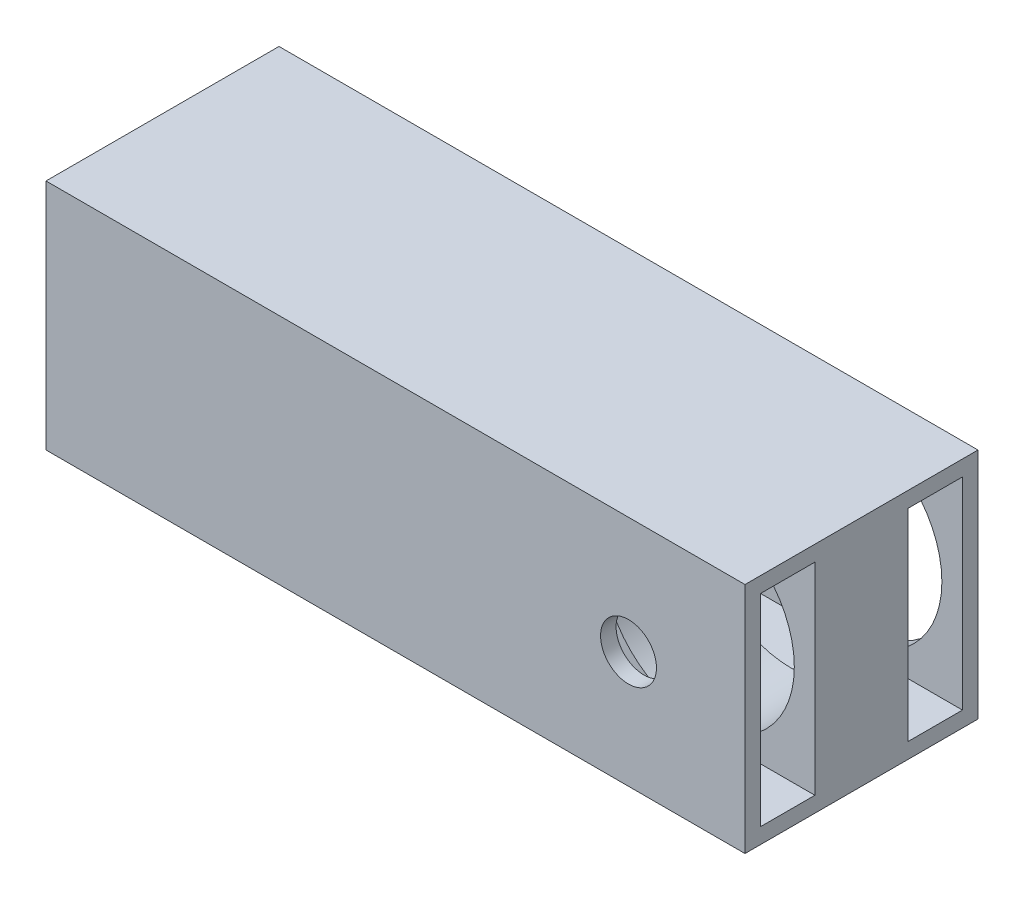
ISO-10303-21;
HEADER;
FILE_DESCRIPTION(('STEP AP214'),'2;1');
FILE_NAME('part.step','',(''),(''),'','','');
FILE_SCHEMA(('AUTOMOTIVE_DESIGN { 1 0 10303 214 1 1 1 1 }'));
ENDSEC;
DATA;
#1=APPLICATION_CONTEXT('core data for automotive mechanical design processes');
#2=APPLICATION_PROTOCOL_DEFINITION('international standard','automotive_design',2000,#1);
#3=PRODUCT_CONTEXT('',#1,'mechanical');
#4=PRODUCT('Part','Part','',(#3));
#5=PRODUCT_RELATED_PRODUCT_CATEGORY('part','',(#4));
#6=PRODUCT_DEFINITION_FORMATION('','',#4);
#7=PRODUCT_DEFINITION_CONTEXT('part definition',#1,'design');
#8=PRODUCT_DEFINITION('design','',#6,#7);
#9=PRODUCT_DEFINITION_SHAPE('','',#8);
#10=(LENGTH_UNIT() NAMED_UNIT(*) SI_UNIT(.MILLI.,.METRE.));
#11=(NAMED_UNIT(*) PLANE_ANGLE_UNIT() SI_UNIT($,.RADIAN.));
#12=(NAMED_UNIT(*) SI_UNIT($,.STERADIAN.) SOLID_ANGLE_UNIT());
#13=UNCERTAINTY_MEASURE_WITH_UNIT(LENGTH_MEASURE(1.E-05),#10,'distance_accuracy_value','');
#14=(GEOMETRIC_REPRESENTATION_CONTEXT(3) GLOBAL_UNCERTAINTY_ASSIGNED_CONTEXT((#13)) GLOBAL_UNIT_ASSIGNED_CONTEXT((#10,
#11,#12)) REPRESENTATION_CONTEXT('',''));
#15=CARTESIAN_POINT('',(0.,0.,0.));
#16=DIRECTION('',(0.,0.,1.));
#17=DIRECTION('',(1.,0.,0.));
#18=AXIS2_PLACEMENT_3D('',#15,#16,#17);
#19=CARTESIAN_POINT('',(90.,0.,0.));
#20=DIRECTION('',(-1.,0.,0.));
#21=DIRECTION('',(0.,0.,1.));
#22=AXIS2_PLACEMENT_3D('',#19,#20,#21);
#23=PLANE('',#22);
#24=DIRECTION('',(0.,-1.,0.));
#25=VECTOR('',#24,1.);
#26=CARTESIAN_POINT('',(90.,13.,13.));
#27=LINE('',#26,#25);
#28=CARTESIAN_POINT('',(90.,13.,13.));
#29=VERTEX_POINT('',#28);
#30=CARTESIAN_POINT('',(90.,-13.,13.));
#31=VERTEX_POINT('',#30);
#32=EDGE_CURVE('E168',#29,#31,#27,.T.);
#33=ORIENTED_EDGE('',*,*,#32,.F.);
#34=DIRECTION('',(0.,0.,1.));
#35=VECTOR('',#34,1.);
#36=CARTESIAN_POINT('',(90.,13.,13.));
#37=LINE('',#36,#35);
#38=CARTESIAN_POINT('',(90.,13.,6.));
#39=VERTEX_POINT('',#38);
#40=EDGE_CURVE('E176',#39,#29,#37,.T.);
#41=ORIENTED_EDGE('',*,*,#40,.F.);
#42=DIRECTION('',(0.,1.,0.));
#43=VECTOR('',#42,1.);
#44=CARTESIAN_POINT('',(90.,13.,6.));
#45=LINE('',#44,#43);
#46=CARTESIAN_POINT('',(90.,-13.,6.));
#47=VERTEX_POINT('',#46);
#48=EDGE_CURVE('E173',#47,#39,#45,.T.);
#49=ORIENTED_EDGE('',*,*,#48,.F.);
#50=DIRECTION('',(0.,0.,-1.));
#51=VECTOR('',#50,1.);
#52=CARTESIAN_POINT('',(90.,-13.,13.));
#53=LINE('',#52,#51);
#54=EDGE_CURVE('E170',#31,#47,#53,.T.);
#55=ORIENTED_EDGE('',*,*,#54,.F.);
#56=EDGE_LOOP('',(#33,#41,#49,#55));
#57=FACE_BOUND('',#56,.T.);
#58=DIRECTION('',(0.,1.,0.));
#59=VECTOR('',#58,1.);
#60=CARTESIAN_POINT('',(90.,-15.,-15.));
#61=LINE('',#60,#59);
#62=CARTESIAN_POINT('',(90.,-15.,-15.));
#63=VERTEX_POINT('',#62);
#64=CARTESIAN_POINT('',(90.,15.,-15.));
#65=VERTEX_POINT('',#64);
#66=EDGE_CURVE('E199',#63,#65,#61,.T.);
#67=ORIENTED_EDGE('',*,*,#66,.T.);
#68=DIRECTION('',(0.,0.,1.));
#69=VECTOR('',#68,1.);
#70=CARTESIAN_POINT('',(90.,15.,15.));
#71=LINE('',#70,#69);
#72=CARTESIAN_POINT('',(90.,15.,15.));
#73=VERTEX_POINT('',#72);
#74=EDGE_CURVE('E202',#65,#73,#71,.T.);
#75=ORIENTED_EDGE('',*,*,#74,.T.);
#76=DIRECTION('',(0.,-1.,0.));
#77=VECTOR('',#76,1.);
#78=CARTESIAN_POINT('',(90.,-15.,15.));
#79=LINE('',#78,#77);
#80=CARTESIAN_POINT('',(90.,-15.,15.));
#81=VERTEX_POINT('',#80);
#82=EDGE_CURVE('E205',#73,#81,#79,.T.);
#83=ORIENTED_EDGE('',*,*,#82,.T.);
#84=DIRECTION('',(0.,0.,-1.));
#85=VECTOR('',#84,1.);
#86=CARTESIAN_POINT('',(90.,-15.,15.));
#87=LINE('',#86,#85);
#88=EDGE_CURVE('E207',#81,#63,#87,.T.);
#89=ORIENTED_EDGE('',*,*,#88,.T.);
#90=EDGE_LOOP('',(#67,#75,#83,#89));
#91=FACE_BOUND('',#90,.T.);
#92=DIRECTION('',(0.,1.,0.));
#93=VECTOR('',#92,1.);
#94=CARTESIAN_POINT('',(90.,13.,-13.));
#95=LINE('',#94,#93);
#96=CARTESIAN_POINT('',(90.,-13.,-13.));
#97=VERTEX_POINT('',#96);
#98=CARTESIAN_POINT('',(90.,13.,-13.));
#99=VERTEX_POINT('',#98);
#100=EDGE_CURVE('E130',#97,#99,#95,.T.);
#101=ORIENTED_EDGE('',*,*,#100,.F.);
#102=DIRECTION('',(0.,0.,-1.));
#103=VECTOR('',#102,1.);
#104=CARTESIAN_POINT('',(90.,-13.,-13.));
#105=LINE('',#104,#103);
#106=CARTESIAN_POINT('',(90.,-13.,-6.));
#107=VERTEX_POINT('',#106);
#108=EDGE_CURVE('E152',#107,#97,#105,.T.);
#109=ORIENTED_EDGE('',*,*,#108,.F.);
#110=DIRECTION('',(0.,-1.,0.));
#111=VECTOR('',#110,1.);
#112=CARTESIAN_POINT('',(90.,13.,-6.));
#113=LINE('',#112,#111);
#114=CARTESIAN_POINT('',(90.,13.,-6.));
#115=VERTEX_POINT('',#114);
#116=EDGE_CURVE('E150',#115,#107,#113,.T.);
#117=ORIENTED_EDGE('',*,*,#116,.F.);
#118=DIRECTION('',(0.,0.,1.));
#119=VECTOR('',#118,1.);
#120=CARTESIAN_POINT('',(90.,13.,-13.));
#121=LINE('',#120,#119);
#122=EDGE_CURVE('E138',#99,#115,#121,.T.);
#123=ORIENTED_EDGE('',*,*,#122,.F.);
#124=EDGE_LOOP('',(#101,#109,#117,#123));
#125=FACE_BOUND('',#124,.T.);
#126=ADVANCED_FACE('F39',(#57,#91,#125),#23,.F.);
#127=CARTESIAN_POINT('',(0.,0.,0.));
#128=DIRECTION('',(-1.,0.,0.));
#129=DIRECTION('',(0.,0.,1.));
#130=AXIS2_PLACEMENT_3D('',#127,#128,#129);
#131=PLANE('',#130);
#132=DIRECTION('',(0.,1.,0.));
#133=VECTOR('',#132,1.);
#134=CARTESIAN_POINT('',(0.,-15.,-15.));
#135=LINE('',#134,#133);
#136=CARTESIAN_POINT('',(0.,-15.,-15.));
#137=VERTEX_POINT('',#136);
#138=CARTESIAN_POINT('',(0.,15.,-15.));
#139=VERTEX_POINT('',#138);
#140=EDGE_CURVE('E198',#137,#139,#135,.T.);
#141=ORIENTED_EDGE('',*,*,#140,.F.);
#142=DIRECTION('',(0.,0.,-1.));
#143=VECTOR('',#142,1.);
#144=CARTESIAN_POINT('',(0.,-15.,15.));
#145=LINE('',#144,#143);
#146=CARTESIAN_POINT('',(0.,-15.,15.));
#147=VERTEX_POINT('',#146);
#148=EDGE_CURVE('E203',#147,#137,#145,.T.);
#149=ORIENTED_EDGE('',*,*,#148,.F.);
#150=DIRECTION('',(0.,-1.,0.));
#151=VECTOR('',#150,1.);
#152=CARTESIAN_POINT('',(0.,-15.,15.));
#153=LINE('',#152,#151);
#154=CARTESIAN_POINT('',(0.,15.,15.));
#155=VERTEX_POINT('',#154);
#156=EDGE_CURVE('E214',#155,#147,#153,.T.);
#157=ORIENTED_EDGE('',*,*,#156,.F.);
#158=DIRECTION('',(0.,0.,1.));
#159=VECTOR('',#158,1.);
#160=CARTESIAN_POINT('',(0.,15.,15.));
#161=LINE('',#160,#159);
#162=EDGE_CURVE('E212',#139,#155,#161,.T.);
#163=ORIENTED_EDGE('',*,*,#162,.F.);
#164=EDGE_LOOP('',(#141,#149,#157,#163));
#165=FACE_BOUND('',#164,.T.);
#166=DIRECTION('',(0.,0.,1.));
#167=VECTOR('',#166,1.);
#168=CARTESIAN_POINT('',(0.,13.,13.));
#169=LINE('',#168,#167);
#170=CARTESIAN_POINT('',(0.,13.,6.));
#171=VERTEX_POINT('',#170);
#172=CARTESIAN_POINT('',(0.,13.,13.));
#173=VERTEX_POINT('',#172);
#174=EDGE_CURVE('E171',#171,#173,#169,.T.);
#175=ORIENTED_EDGE('',*,*,#174,.T.);
#176=DIRECTION('',(0.,-1.,0.));
#177=VECTOR('',#176,1.);
#178=CARTESIAN_POINT('',(0.,13.,13.));
#179=LINE('',#178,#177);
#180=CARTESIAN_POINT('',(0.,-13.,13.));
#181=VERTEX_POINT('',#180);
#182=EDGE_CURVE('E146',#173,#181,#179,.T.);
#183=ORIENTED_EDGE('',*,*,#182,.T.);
#184=DIRECTION('',(0.,0.,-1.));
#185=VECTOR('',#184,1.);
#186=CARTESIAN_POINT('',(0.,-13.,13.));
#187=LINE('',#186,#185);
#188=CARTESIAN_POINT('',(0.,-13.,6.));
#189=VERTEX_POINT('',#188);
#190=EDGE_CURVE('E181',#181,#189,#187,.T.);
#191=ORIENTED_EDGE('',*,*,#190,.T.);
#192=DIRECTION('',(0.,1.,0.));
#193=VECTOR('',#192,1.);
#194=CARTESIAN_POINT('',(0.,13.,6.));
#195=LINE('',#194,#193);
#196=EDGE_CURVE('E184',#189,#171,#195,.T.);
#197=ORIENTED_EDGE('',*,*,#196,.T.);
#198=EDGE_LOOP('',(#175,#183,#191,#197));
#199=FACE_BOUND('',#198,.T.);
#200=DIRECTION('',(0.,0.,-1.));
#201=VECTOR('',#200,1.);
#202=CARTESIAN_POINT('',(0.,-13.,-13.));
#203=LINE('',#202,#201);
#204=CARTESIAN_POINT('',(0.,-13.,-6.));
#205=VERTEX_POINT('',#204);
#206=CARTESIAN_POINT('',(0.,-13.,-13.));
#207=VERTEX_POINT('',#206);
#208=EDGE_CURVE('E139',#205,#207,#203,.T.);
#209=ORIENTED_EDGE('',*,*,#208,.T.);
#210=DIRECTION('',(0.,1.,0.));
#211=VECTOR('',#210,1.);
#212=CARTESIAN_POINT('',(0.,13.,-13.));
#213=LINE('',#212,#211);
#214=CARTESIAN_POINT('',(0.,13.,-13.));
#215=VERTEX_POINT('',#214);
#216=EDGE_CURVE('E64',#207,#215,#213,.T.);
#217=ORIENTED_EDGE('',*,*,#216,.T.);
#218=DIRECTION('',(0.,0.,1.));
#219=VECTOR('',#218,1.);
#220=CARTESIAN_POINT('',(0.,13.,-13.));
#221=LINE('',#220,#219);
#222=CARTESIAN_POINT('',(0.,13.,-6.));
#223=VERTEX_POINT('',#222);
#224=EDGE_CURVE('E145',#215,#223,#221,.T.);
#225=ORIENTED_EDGE('',*,*,#224,.T.);
#226=DIRECTION('',(0.,-1.,0.));
#227=VECTOR('',#226,1.);
#228=CARTESIAN_POINT('',(0.,13.,-6.));
#229=LINE('',#228,#227);
#230=EDGE_CURVE('E160',#223,#205,#229,.T.);
#231=ORIENTED_EDGE('',*,*,#230,.T.);
#232=EDGE_LOOP('',(#209,#217,#225,#231));
#233=FACE_BOUND('',#232,.T.);
#234=ADVANCED_FACE('F254',(#165,#199,#233),#131,.T.);
#235=CARTESIAN_POINT('',(90.,-15.,-15.));
#236=DIRECTION('',(0.,0.,1.));
#237=DIRECTION('',(1.,0.,0.));
#238=AXIS2_PLACEMENT_3D('',#235,#236,#237);
#239=PLANE('',#238);
#240=CARTESIAN_POINT('',(75.,0.,-15.));
#241=DIRECTION('',(0.,0.,-1.));
#242=DIRECTION('',(-1.,0.,0.));
#243=AXIS2_PLACEMENT_3D('',#240,#241,#242);
#244=CIRCLE('',#243,12.35);
#245=CARTESIAN_POINT('',(62.65,0.,-15.));
#246=VERTEX_POINT('',#245);
#247=EDGE_CURVE('E226',#246,#246,#244,.T.);
#248=ORIENTED_EDGE('',*,*,#247,.F.);
#249=EDGE_LOOP('',(#248));
#250=FACE_BOUND('',#249,.T.);
#251=ORIENTED_EDGE('',*,*,#140,.T.);
#252=DIRECTION('',(-1.,0.,0.));
#253=VECTOR('',#252,1.);
#254=CARTESIAN_POINT('',(90.,15.,-15.));
#255=LINE('',#254,#253);
#256=EDGE_CURVE('E11',#65,#139,#255,.T.);
#257=ORIENTED_EDGE('',*,*,#256,.F.);
#258=ORIENTED_EDGE('',*,*,#66,.F.);
#259=DIRECTION('',(-1.,0.,0.));
#260=VECTOR('',#259,1.);
#261=CARTESIAN_POINT('',(90.,-15.,-15.));
#262=LINE('',#261,#260);
#263=EDGE_CURVE('E209',#63,#137,#262,.T.);
#264=ORIENTED_EDGE('',*,*,#263,.T.);
#265=EDGE_LOOP('',(#251,#257,#258,#264));
#266=FACE_BOUND('',#265,.T.);
#267=ADVANCED_FACE('F41',(#250,#266),#239,.F.);
#268=CARTESIAN_POINT('',(90.,15.,15.));
#269=DIRECTION('',(0.,-1.,0.));
#270=DIRECTION('',(0.,0.,-1.));
#271=AXIS2_PLACEMENT_3D('',#268,#269,#270);
#272=PLANE('',#271);
#273=ORIENTED_EDGE('',*,*,#162,.T.);
#274=DIRECTION('',(-1.,0.,0.));
#275=VECTOR('',#274,1.);
#276=CARTESIAN_POINT('',(90.,15.,15.));
#277=LINE('',#276,#275);
#278=EDGE_CURVE('E48',#73,#155,#277,.T.);
#279=ORIENTED_EDGE('',*,*,#278,.F.);
#280=ORIENTED_EDGE('',*,*,#74,.F.);
#281=ORIENTED_EDGE('',*,*,#256,.T.);
#282=EDGE_LOOP('',(#273,#279,#280,#281));
#283=FACE_BOUND('',#282,.T.);
#284=ADVANCED_FACE('F292',(#283),#272,.F.);
#285=CARTESIAN_POINT('',(90.,-15.,15.));
#286=DIRECTION('',(0.,0.,-1.));
#287=DIRECTION('',(-1.,0.,0.));
#288=AXIS2_PLACEMENT_3D('',#285,#286,#287);
#289=PLANE('',#288);
#290=CARTESIAN_POINT('',(75.,0.,15.));
#291=DIRECTION('',(0.,0.,1.));
#292=DIRECTION('',(1.,0.,0.));
#293=AXIS2_PLACEMENT_3D('',#290,#291,#292);
#294=CIRCLE('',#293,3.6);
#295=CARTESIAN_POINT('',(78.6,0.,15.));
#296=VERTEX_POINT('',#295);
#297=EDGE_CURVE('E236',#296,#296,#294,.T.);
#298=ORIENTED_EDGE('',*,*,#297,.F.);
#299=EDGE_LOOP('',(#298));
#300=FACE_BOUND('',#299,.T.);
#301=ORIENTED_EDGE('',*,*,#156,.T.);
#302=DIRECTION('',(-1.,0.,0.));
#303=VECTOR('',#302,1.);
#304=CARTESIAN_POINT('',(90.,-15.,15.));
#305=LINE('',#304,#303);
#306=EDGE_CURVE('E219',#81,#147,#305,.T.);
#307=ORIENTED_EDGE('',*,*,#306,.F.);
#308=ORIENTED_EDGE('',*,*,#82,.F.);
#309=ORIENTED_EDGE('',*,*,#278,.T.);
#310=EDGE_LOOP('',(#301,#307,#308,#309));
#311=FACE_BOUND('',#310,.T.);
#312=ADVANCED_FACE('F289',(#300,#311),#289,.F.);
#313=CARTESIAN_POINT('',(90.,-15.,15.));
#314=DIRECTION('',(0.,1.,0.));
#315=DIRECTION('',(0.,0.,1.));
#316=AXIS2_PLACEMENT_3D('',#313,#314,#315);
#317=PLANE('',#316);
#318=ORIENTED_EDGE('',*,*,#148,.T.);
#319=ORIENTED_EDGE('',*,*,#263,.F.);
#320=ORIENTED_EDGE('',*,*,#88,.F.);
#321=ORIENTED_EDGE('',*,*,#306,.T.);
#322=EDGE_LOOP('',(#318,#319,#320,#321));
#323=FACE_BOUND('',#322,.T.);
#324=ADVANCED_FACE('F286',(#323),#317,.F.);
#325=CARTESIAN_POINT('',(90.,13.,13.));
#326=DIRECTION('',(0.,0.,-1.));
#327=DIRECTION('',(0.,1.,0.));
#328=AXIS2_PLACEMENT_3D('',#325,#326,#327);
#329=PLANE('',#328);
#330=CARTESIAN_POINT('',(75.,0.,13.));
#331=DIRECTION('',(0.,0.,-1.));
#332=DIRECTION('',(0.,1.,0.));
#333=AXIS2_PLACEMENT_3D('',#330,#331,#332);
#334=CIRCLE('',#333,3.6);
#335=CARTESIAN_POINT('',(75.,3.6,13.));
#336=VERTEX_POINT('',#335);
#337=EDGE_CURVE('E43',#336,#336,#334,.T.);
#338=ORIENTED_EDGE('',*,*,#337,.F.);
#339=EDGE_LOOP('',(#338));
#340=FACE_BOUND('',#339,.T.);
#341=ORIENTED_EDGE('',*,*,#182,.F.);
#342=DIRECTION('',(-1.,0.,0.));
#343=VECTOR('',#342,1.);
#344=CARTESIAN_POINT('',(90.,13.,13.));
#345=LINE('',#344,#343);
#346=EDGE_CURVE('E178',#29,#173,#345,.T.);
#347=ORIENTED_EDGE('',*,*,#346,.F.);
#348=ORIENTED_EDGE('',*,*,#32,.T.);
#349=DIRECTION('',(-1.,0.,0.));
#350=VECTOR('',#349,1.);
#351=CARTESIAN_POINT('',(90.,-13.,13.));
#352=LINE('',#351,#350);
#353=EDGE_CURVE('E195',#31,#181,#352,.T.);
#354=ORIENTED_EDGE('',*,*,#353,.T.);
#355=EDGE_LOOP('',(#341,#347,#348,#354));
#356=FACE_BOUND('',#355,.T.);
#357=ADVANCED_FACE('F260',(#340,#356),#329,.T.);
#358=CARTESIAN_POINT('',(90.,-13.,13.));
#359=DIRECTION('',(0.,1.,0.));
#360=DIRECTION('',(0.,0.,1.));
#361=AXIS2_PLACEMENT_3D('',#358,#359,#360);
#362=PLANE('',#361);
#363=ORIENTED_EDGE('',*,*,#190,.F.);
#364=ORIENTED_EDGE('',*,*,#353,.F.);
#365=ORIENTED_EDGE('',*,*,#54,.T.);
#366=DIRECTION('',(-1.,0.,0.));
#367=VECTOR('',#366,1.);
#368=CARTESIAN_POINT('',(90.,-13.,6.));
#369=LINE('',#368,#367);
#370=EDGE_CURVE('E193',#47,#189,#369,.T.);
#371=ORIENTED_EDGE('',*,*,#370,.T.);
#372=EDGE_LOOP('',(#363,#364,#365,#371));
#373=FACE_BOUND('',#372,.T.);
#374=ADVANCED_FACE('F247',(#373),#362,.T.);
#375=CARTESIAN_POINT('',(90.,13.,6.));
#376=DIRECTION('',(0.,0.,1.));
#377=DIRECTION('',(0.,-1.,0.));
#378=AXIS2_PLACEMENT_3D('',#375,#376,#377);
#379=PLANE('',#378);
#380=CARTESIAN_POINT('',(75.,0.,6.));
#381=DIRECTION('',(0.,0.,1.));
#382=DIRECTION('',(0.,-1.,0.));
#383=AXIS2_PLACEMENT_3D('',#380,#381,#382);
#384=CIRCLE('',#383,12.35);
#385=CARTESIAN_POINT('',(75.,-12.35,6.));
#386=VERTEX_POINT('',#385);
#387=EDGE_CURVE('E158',#386,#386,#384,.T.);
#388=ORIENTED_EDGE('',*,*,#387,.F.);
#389=EDGE_LOOP('',(#388));
#390=FACE_BOUND('',#389,.T.);
#391=ORIENTED_EDGE('',*,*,#196,.F.);
#392=ORIENTED_EDGE('',*,*,#370,.F.);
#393=ORIENTED_EDGE('',*,*,#48,.T.);
#394=DIRECTION('',(-1.,0.,0.));
#395=VECTOR('',#394,1.);
#396=CARTESIAN_POINT('',(90.,13.,6.));
#397=LINE('',#396,#395);
#398=EDGE_CURVE('E191',#39,#171,#397,.T.);
#399=ORIENTED_EDGE('',*,*,#398,.T.);
#400=EDGE_LOOP('',(#391,#392,#393,#399));
#401=FACE_BOUND('',#400,.T.);
#402=ADVANCED_FACE('F243',(#390,#401),#379,.T.);
#403=CARTESIAN_POINT('',(90.,13.,13.));
#404=DIRECTION('',(0.,-1.,0.));
#405=DIRECTION('',(0.,0.,-1.));
#406=AXIS2_PLACEMENT_3D('',#403,#404,#405);
#407=PLANE('',#406);
#408=ORIENTED_EDGE('',*,*,#174,.F.);
#409=ORIENTED_EDGE('',*,*,#398,.F.);
#410=ORIENTED_EDGE('',*,*,#40,.T.);
#411=ORIENTED_EDGE('',*,*,#346,.T.);
#412=EDGE_LOOP('',(#408,#409,#410,#411));
#413=FACE_BOUND('',#412,.T.);
#414=ADVANCED_FACE('F246',(#413),#407,.T.);
#415=CARTESIAN_POINT('',(90.,13.,-13.));
#416=DIRECTION('',(0.,0.,1.));
#417=DIRECTION('',(0.,-1.,0.));
#418=AXIS2_PLACEMENT_3D('',#415,#416,#417);
#419=PLANE('',#418);
#420=CARTESIAN_POINT('',(75.,0.,-13.));
#421=DIRECTION('',(0.,0.,1.));
#422=DIRECTION('',(0.,-1.,0.));
#423=AXIS2_PLACEMENT_3D('',#420,#421,#422);
#424=CIRCLE('',#423,12.35);
#425=CARTESIAN_POINT('',(75.,-12.35,-13.));
#426=VERTEX_POINT('',#425);
#427=EDGE_CURVE('E225',#426,#426,#424,.T.);
#428=ORIENTED_EDGE('',*,*,#427,.F.);
#429=EDGE_LOOP('',(#428));
#430=FACE_BOUND('',#429,.T.);
#431=ORIENTED_EDGE('',*,*,#216,.F.);
#432=DIRECTION('',(-1.,0.,0.));
#433=VECTOR('',#432,1.);
#434=CARTESIAN_POINT('',(90.,-13.,-13.));
#435=LINE('',#434,#433);
#436=EDGE_CURVE('E134',#97,#207,#435,.T.);
#437=ORIENTED_EDGE('',*,*,#436,.F.);
#438=ORIENTED_EDGE('',*,*,#100,.T.);
#439=DIRECTION('',(-1.,0.,0.));
#440=VECTOR('',#439,1.);
#441=CARTESIAN_POINT('',(90.,13.,-13.));
#442=LINE('',#441,#440);
#443=EDGE_CURVE('E133',#99,#215,#442,.T.);
#444=ORIENTED_EDGE('',*,*,#443,.T.);
#445=EDGE_LOOP('',(#431,#437,#438,#444));
#446=FACE_BOUND('',#445,.T.);
#447=ADVANCED_FACE('F132',(#430,#446),#419,.T.);
#448=CARTESIAN_POINT('',(90.,13.,-13.));
#449=DIRECTION('',(0.,-1.,0.));
#450=DIRECTION('',(0.,0.,-1.));
#451=AXIS2_PLACEMENT_3D('',#448,#449,#450);
#452=PLANE('',#451);
#453=ORIENTED_EDGE('',*,*,#224,.F.);
#454=ORIENTED_EDGE('',*,*,#443,.F.);
#455=ORIENTED_EDGE('',*,*,#122,.T.);
#456=DIRECTION('',(-1.,0.,0.));
#457=VECTOR('',#456,1.);
#458=CARTESIAN_POINT('',(90.,13.,-6.));
#459=LINE('',#458,#457);
#460=EDGE_CURVE('E147',#115,#223,#459,.T.);
#461=ORIENTED_EDGE('',*,*,#460,.T.);
#462=EDGE_LOOP('',(#453,#454,#455,#461));
#463=FACE_BOUND('',#462,.T.);
#464=ADVANCED_FACE('F142',(#463),#452,.T.);
#465=CARTESIAN_POINT('',(90.,13.,-6.));
#466=DIRECTION('',(0.,0.,-1.));
#467=DIRECTION('',(0.,1.,0.));
#468=AXIS2_PLACEMENT_3D('',#465,#466,#467);
#469=PLANE('',#468);
#470=CARTESIAN_POINT('',(75.,0.,-6.));
#471=DIRECTION('',(0.,0.,-1.));
#472=DIRECTION('',(0.,1.,0.));
#473=AXIS2_PLACEMENT_3D('',#470,#471,#472);
#474=CIRCLE('',#473,12.35);
#475=CARTESIAN_POINT('',(75.,12.35,-6.));
#476=VERTEX_POINT('',#475);
#477=EDGE_CURVE('E223',#476,#476,#474,.T.);
#478=ORIENTED_EDGE('',*,*,#477,.F.);
#479=EDGE_LOOP('',(#478));
#480=FACE_BOUND('',#479,.T.);
#481=ORIENTED_EDGE('',*,*,#230,.F.);
#482=ORIENTED_EDGE('',*,*,#460,.F.);
#483=ORIENTED_EDGE('',*,*,#116,.T.);
#484=DIRECTION('',(-1.,0.,0.));
#485=VECTOR('',#484,1.);
#486=CARTESIAN_POINT('',(90.,-13.,-6.));
#487=LINE('',#486,#485);
#488=EDGE_CURVE('E56',#107,#205,#487,.T.);
#489=ORIENTED_EDGE('',*,*,#488,.T.);
#490=EDGE_LOOP('',(#481,#482,#483,#489));
#491=FACE_BOUND('',#490,.T.);
#492=ADVANCED_FACE('F335',(#480,#491),#469,.T.);
#493=CARTESIAN_POINT('',(90.,-13.,-13.));
#494=DIRECTION('',(0.,1.,0.));
#495=DIRECTION('',(0.,0.,1.));
#496=AXIS2_PLACEMENT_3D('',#493,#494,#495);
#497=PLANE('',#496);
#498=ORIENTED_EDGE('',*,*,#208,.F.);
#499=ORIENTED_EDGE('',*,*,#488,.F.);
#500=ORIENTED_EDGE('',*,*,#108,.T.);
#501=ORIENTED_EDGE('',*,*,#436,.T.);
#502=EDGE_LOOP('',(#498,#499,#500,#501));
#503=FACE_BOUND('',#502,.T.);
#504=ADVANCED_FACE('F319',(#503),#497,.T.);
#505=CARTESIAN_POINT('',(75.,0.,8.00000000000004));
#506=DIRECTION('',(0.,0.,-1.));
#507=DIRECTION('',(-1.,0.,0.));
#508=AXIS2_PLACEMENT_3D('',#505,#506,#507);
#509=CYLINDRICAL_SURFACE('',#508,12.35);
#510=ORIENTED_EDGE('',*,*,#387,.T.);
#511=EDGE_LOOP('',(#510));
#512=FACE_BOUND('',#511,.T.);
#513=ORIENTED_EDGE('',*,*,#477,.T.);
#514=EDGE_LOOP('',(#513));
#515=FACE_BOUND('',#514,.T.);
#516=ADVANCED_FACE('F241',(#512,#515),#509,.F.);
#517=ORIENTED_EDGE('',*,*,#427,.T.);
#518=EDGE_LOOP('',(#517));
#519=FACE_BOUND('',#518,.T.);
#520=ORIENTED_EDGE('',*,*,#247,.T.);
#521=EDGE_LOOP('',(#520));
#522=FACE_BOUND('',#521,.T.);
#523=ADVANCED_FACE('F347',(#519,#522),#509,.F.);
#524=CARTESIAN_POINT('',(75.,0.,-2.00000000000003));
#525=DIRECTION('',(0.,0.,1.));
#526=DIRECTION('',(1.,0.,0.));
#527=AXIS2_PLACEMENT_3D('',#524,#525,#526);
#528=CYLINDRICAL_SURFACE('',#527,3.6);
#529=ORIENTED_EDGE('',*,*,#337,.T.);
#530=EDGE_LOOP('',(#529));
#531=FACE_BOUND('',#530,.T.);
#532=ORIENTED_EDGE('',*,*,#297,.T.);
#533=EDGE_LOOP('',(#532));
#534=FACE_BOUND('',#533,.T.);
#535=ADVANCED_FACE('F354',(#531,#534),#528,.F.);
#536=CLOSED_SHELL('',(#126,#234,#267,#284,#312,#324,#357,#374,#402,#414,#447,#464,#492,#504,
#516,#523,#535));
#537=MANIFOLD_SOLID_BREP('B2',#536);
#538=ADVANCED_BREP_SHAPE_REPRESENTATION('',(#18,#537),#14);
#539=SHAPE_DEFINITION_REPRESENTATION(#9,#538);
ENDSEC;
END-ISO-10303-21;
